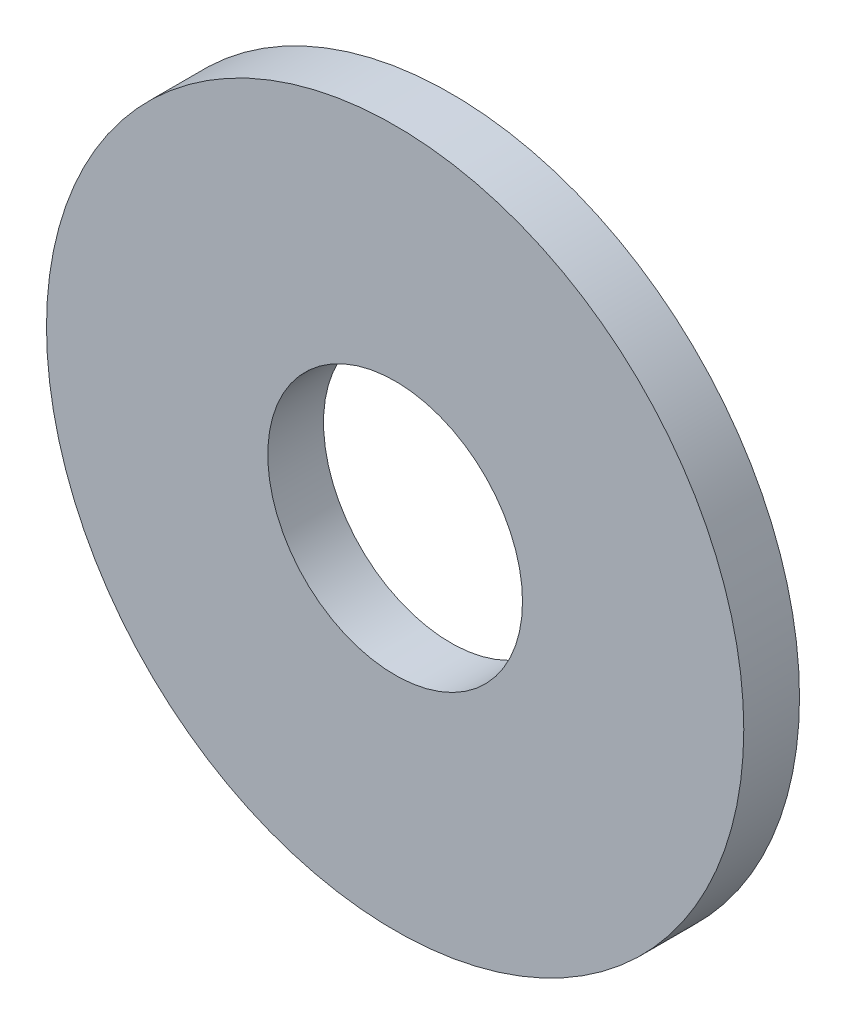
ISO-10303-21;
HEADER;
FILE_DESCRIPTION(('STEP AP214'),'2;1');
FILE_NAME('part.step','',(''),(''),'','','');
FILE_SCHEMA(('AUTOMOTIVE_DESIGN { 1 0 10303 214 1 1 1 1 }'));
ENDSEC;
DATA;
#1=APPLICATION_CONTEXT('core data for automotive mechanical design processes');
#2=APPLICATION_PROTOCOL_DEFINITION('international standard','automotive_design',2000,#1);
#3=PRODUCT_CONTEXT('',#1,'mechanical');
#4=PRODUCT('Part','Part','',(#3));
#5=PRODUCT_RELATED_PRODUCT_CATEGORY('part','',(#4));
#6=PRODUCT_DEFINITION_FORMATION('','',#4);
#7=PRODUCT_DEFINITION_CONTEXT('part definition',#1,'design');
#8=PRODUCT_DEFINITION('design','',#6,#7);
#9=PRODUCT_DEFINITION_SHAPE('','',#8);
#10=(LENGTH_UNIT() NAMED_UNIT(*) SI_UNIT(.MILLI.,.METRE.));
#11=(NAMED_UNIT(*) PLANE_ANGLE_UNIT() SI_UNIT($,.RADIAN.));
#12=(NAMED_UNIT(*) SI_UNIT($,.STERADIAN.) SOLID_ANGLE_UNIT());
#13=UNCERTAINTY_MEASURE_WITH_UNIT(LENGTH_MEASURE(1.E-05),#10,'distance_accuracy_value','');
#14=(GEOMETRIC_REPRESENTATION_CONTEXT(3) GLOBAL_UNCERTAINTY_ASSIGNED_CONTEXT((#13)) GLOBAL_UNIT_ASSIGNED_CONTEXT((#10,
#11,#12)) REPRESENTATION_CONTEXT('',''));
#15=CARTESIAN_POINT('',(0.,0.,0.));
#16=DIRECTION('',(0.,0.,1.));
#17=DIRECTION('',(1.,0.,0.));
#18=AXIS2_PLACEMENT_3D('',#15,#16,#17);
#19=CARTESIAN_POINT('',(0.,0.,0.7));
#20=DIRECTION('',(0.,0.,1.));
#21=DIRECTION('',(1.,0.,0.));
#22=AXIS2_PLACEMENT_3D('',#19,#20,#21);
#23=PLANE('',#22);
#24=CARTESIAN_POINT('',(0.,0.,0.7));
#25=DIRECTION('',(0.,0.,1.));
#26=DIRECTION('',(1.,0.,0.));
#27=AXIS2_PLACEMENT_3D('',#24,#25,#26);
#28=CIRCLE('',#27,4.38);
#29=CARTESIAN_POINT('',(4.38,0.,0.7));
#30=VERTEX_POINT('',#29);
#31=EDGE_CURVE('E10',#30,#30,#28,.T.);
#32=ORIENTED_EDGE('',*,*,#31,.T.);
#33=EDGE_LOOP('',(#32));
#34=FACE_BOUND('',#33,.T.);
#35=CARTESIAN_POINT('',(0.,0.,0.7));
#36=DIRECTION('',(0.,0.,1.));
#37=DIRECTION('',(1.,0.,0.));
#38=AXIS2_PLACEMENT_3D('',#35,#36,#37);
#39=CIRCLE('',#38,1.6);
#40=CARTESIAN_POINT('',(1.6,0.,0.7));
#41=VERTEX_POINT('',#40);
#42=EDGE_CURVE('E42',#41,#41,#39,.T.);
#43=ORIENTED_EDGE('',*,*,#42,.F.);
#44=EDGE_LOOP('',(#43));
#45=FACE_BOUND('',#44,.T.);
#46=ADVANCED_FACE('F31',(#34,#45),#23,.T.);
#47=CARTESIAN_POINT('',(0.,0.,0.));
#48=DIRECTION('',(0.,0.,1.));
#49=DIRECTION('',(1.,0.,0.));
#50=AXIS2_PLACEMENT_3D('',#47,#48,#49);
#51=PLANE('',#50);
#52=CARTESIAN_POINT('',(0.,0.,0.));
#53=DIRECTION('',(0.,0.,1.));
#54=DIRECTION('',(1.,0.,0.));
#55=AXIS2_PLACEMENT_3D('',#52,#53,#54);
#56=CIRCLE('',#55,4.38);
#57=CARTESIAN_POINT('',(4.38,0.,0.));
#58=VERTEX_POINT('',#57);
#59=EDGE_CURVE('E35',#58,#58,#56,.T.);
#60=ORIENTED_EDGE('',*,*,#59,.F.);
#61=EDGE_LOOP('',(#60));
#62=FACE_BOUND('',#61,.T.);
#63=CARTESIAN_POINT('',(0.,0.,0.));
#64=DIRECTION('',(0.,0.,1.));
#65=DIRECTION('',(1.,0.,0.));
#66=AXIS2_PLACEMENT_3D('',#63,#64,#65);
#67=CIRCLE('',#66,1.6);
#68=CARTESIAN_POINT('',(1.6,0.,0.));
#69=VERTEX_POINT('',#68);
#70=EDGE_CURVE('E44',#69,#69,#67,.T.);
#71=ORIENTED_EDGE('',*,*,#70,.T.);
#72=EDGE_LOOP('',(#71));
#73=FACE_BOUND('',#72,.T.);
#74=ADVANCED_FACE('F54',(#62,#73),#51,.F.);
#75=CARTESIAN_POINT('',(0.,0.,0.7));
#76=DIRECTION('',(0.,0.,-1.));
#77=DIRECTION('',(-1.,0.,0.));
#78=AXIS2_PLACEMENT_3D('',#75,#76,#77);
#79=CYLINDRICAL_SURFACE('',#78,4.38);
#80=ORIENTED_EDGE('',*,*,#31,.F.);
#81=EDGE_LOOP('',(#80));
#82=FACE_BOUND('',#81,.T.);
#83=ORIENTED_EDGE('',*,*,#59,.T.);
#84=EDGE_LOOP('',(#83));
#85=FACE_BOUND('',#84,.T.);
#86=ADVANCED_FACE('F33',(#82,#85),#79,.T.);
#87=CARTESIAN_POINT('',(0.,0.,0.7));
#88=DIRECTION('',(0.,0.,-1.));
#89=DIRECTION('',(-1.,0.,0.));
#90=AXIS2_PLACEMENT_3D('',#87,#88,#89);
#91=CYLINDRICAL_SURFACE('',#90,1.6);
#92=ORIENTED_EDGE('',*,*,#42,.T.);
#93=EDGE_LOOP('',(#92));
#94=FACE_BOUND('',#93,.T.);
#95=ORIENTED_EDGE('',*,*,#70,.F.);
#96=EDGE_LOOP('',(#95));
#97=FACE_BOUND('',#96,.T.);
#98=ADVANCED_FACE('F50',(#94,#97),#91,.F.);
#99=CLOSED_SHELL('',(#46,#74,#86,#98));
#100=MANIFOLD_SOLID_BREP('B2',#99);
#101=ADVANCED_BREP_SHAPE_REPRESENTATION('',(#18,#100),#14);
#102=SHAPE_DEFINITION_REPRESENTATION(#9,#101);
ENDSEC;
END-ISO-10303-21;
